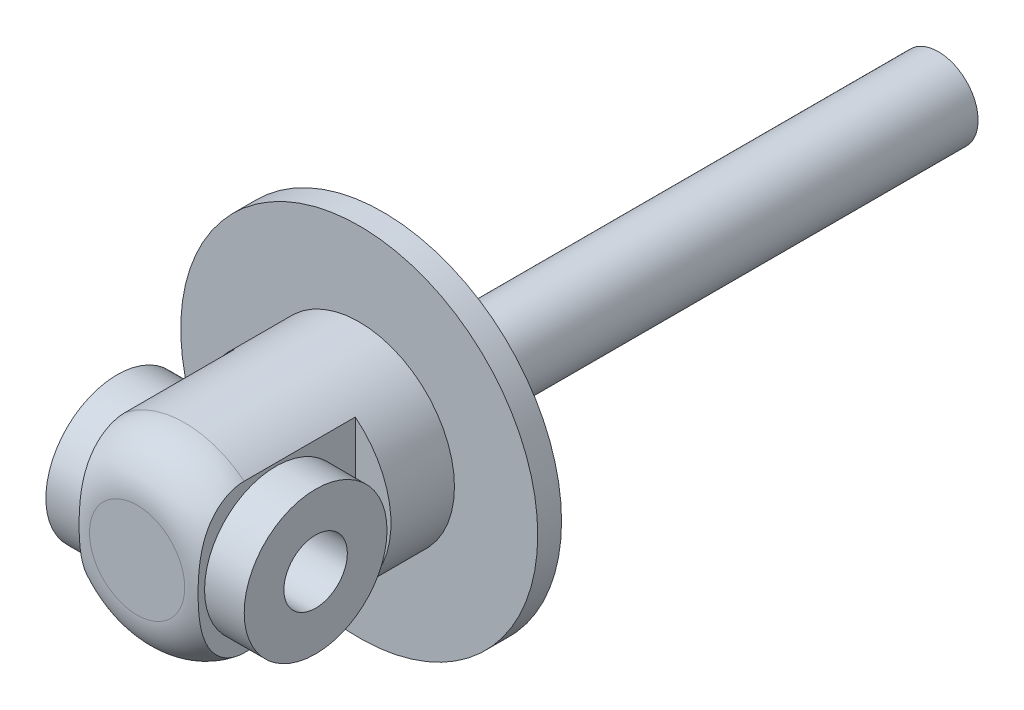
ISO-10303-21;
HEADER;
FILE_DESCRIPTION(('STEP AP214'),'2;1');
FILE_NAME('part.step','',(''),(''),'','','');
FILE_SCHEMA(('AUTOMOTIVE_DESIGN { 1 0 10303 214 1 1 1 1 }'));
ENDSEC;
DATA;
#1=APPLICATION_CONTEXT('core data for automotive mechanical design processes');
#2=APPLICATION_PROTOCOL_DEFINITION('international standard','automotive_design',2000,#1);
#3=PRODUCT_CONTEXT('',#1,'mechanical');
#4=PRODUCT('Part','Part','',(#3));
#5=PRODUCT_RELATED_PRODUCT_CATEGORY('part','',(#4));
#6=PRODUCT_DEFINITION_FORMATION('','',#4);
#7=PRODUCT_DEFINITION_CONTEXT('part definition',#1,'design');
#8=PRODUCT_DEFINITION('design','',#6,#7);
#9=PRODUCT_DEFINITION_SHAPE('','',#8);
#10=(LENGTH_UNIT() NAMED_UNIT(*) SI_UNIT(.MILLI.,.METRE.));
#11=(NAMED_UNIT(*) PLANE_ANGLE_UNIT() SI_UNIT($,.RADIAN.));
#12=(NAMED_UNIT(*) SI_UNIT($,.STERADIAN.) SOLID_ANGLE_UNIT());
#13=UNCERTAINTY_MEASURE_WITH_UNIT(LENGTH_MEASURE(1.E-05),#10,'distance_accuracy_value','');
#14=(GEOMETRIC_REPRESENTATION_CONTEXT(3) GLOBAL_UNCERTAINTY_ASSIGNED_CONTEXT((#13)) GLOBAL_UNIT_ASSIGNED_CONTEXT((#10,
#11,#12)) REPRESENTATION_CONTEXT('',''));
#15=CARTESIAN_POINT('',(0.,0.,0.));
#16=DIRECTION('',(0.,0.,1.));
#17=DIRECTION('',(1.,0.,0.));
#18=AXIS2_PLACEMENT_3D('',#15,#16,#17);
#19=CARTESIAN_POINT('',(-7.5,-22.5,8.));
#20=DIRECTION('',(1.,0.,0.));
#21=DIRECTION('',(0.,0.,-1.));
#22=AXIS2_PLACEMENT_3D('',#19,#20,#21);
#23=PLANE('',#22);
#24=CARTESIAN_POINT('',(-7.5,0.,27.8094750193111));
#25=CARTESIAN_POINT('',(-7.5,0.18452162824242,27.8094752958151));
#26=CARTESIAN_POINT('',(-7.5,0.369043480287192,27.8077270322999));
#27=CARTESIAN_POINT('',(-7.5,0.737999394292285,27.8006130628877));
#28=CARTESIAN_POINT('',(-7.5,0.922433463434385,27.7952477367066));
#29=CARTESIAN_POINT('',(-7.5,1.29122559425462,27.780538513706));
#30=CARTESIAN_POINT('',(-7.5,1.47558358999919,27.7711929215574));
#31=CARTESIAN_POINT('',(-7.5,1.84401846668315,27.7479507640883));
#32=CARTESIAN_POINT('',(-7.5,2.02809534398339,27.734054140347));
#33=CARTESIAN_POINT('',(-7.5,2.39498843631837,27.701027325669));
#34=CARTESIAN_POINT('',(-7.5,2.57780665418326,27.6819201299087));
#35=CARTESIAN_POINT('',(-7.5,2.94269408038083,27.6375682217561));
#36=CARTESIAN_POINT('',(-7.5,3.12476323156505,27.6123230495969));
#37=CARTESIAN_POINT('',(-7.5,3.6691632505479,27.5259360262262));
#38=CARTESIAN_POINT('',(-7.5,4.02997739530099,27.4541196223952));
#39=CARTESIAN_POINT('',(-7.5,4.57935988961709,27.315114172541));
#40=CARTESIAN_POINT('',(-7.5,4.77122256452969,27.2608348848703));
#41=CARTESIAN_POINT('',(-7.5,5.15109529504943,27.1402411036094));
#42=CARTESIAN_POINT('',(-7.5,5.33910680786539,27.0739312594077));
#43=CARTESIAN_POINT('',(-7.5,5.70992505463463,26.9281486989919));
#44=CARTESIAN_POINT('',(-7.5,5.8927332791208,26.8486797977089));
#45=CARTESIAN_POINT('',(-7.5,6.25155879665883,26.6756224712841));
#46=CARTESIAN_POINT('',(-7.5,6.42757723883459,26.5820364486502));
#47=CARTESIAN_POINT('',(-7.5,6.74413785402998,26.3958384208508));
#48=CARTESIAN_POINT('',(-7.5,6.8859302136676,26.3053527427416));
#49=CARTESIAN_POINT('',(-7.5,7.16205254122039,26.1136422044668));
#50=CARTESIAN_POINT('',(-7.5,7.29638393401336,26.0124194056704));
#51=CARTESIAN_POINT('',(-7.5,7.55627452274061,25.7991822855038));
#52=CARTESIAN_POINT('',(-7.5,7.6818315054992,25.6871652583255));
#53=CARTESIAN_POINT('',(-7.5,7.92270374400352,25.4525813942248));
#54=CARTESIAN_POINT('',(-7.5,8.03801892249803,25.3300144777409));
#55=CARTESIAN_POINT('',(-7.5,8.25792234562975,25.0736714823962));
#56=CARTESIAN_POINT('',(-7.5,8.36240569865935,24.9398051473305));
#57=CARTESIAN_POINT('',(-7.5,8.55796576900282,24.662616920615));
#58=CARTESIAN_POINT('',(-7.5,8.64904436046083,24.5192963548439));
#59=CARTESIAN_POINT('',(-7.5,8.81636481076627,24.2243409104845));
#60=CARTESIAN_POINT('',(-7.5,8.89261579636783,24.0727112205184));
#61=CARTESIAN_POINT('',(-7.5,9.02909243430965,23.7624095052739));
#62=CARTESIAN_POINT('',(-7.5,9.08932115899453,23.6037388369551));
#63=CARTESIAN_POINT('',(-7.5,9.1849514334904,23.3052245459151));
#64=CARTESIAN_POINT('',(-7.5,9.22272405795734,23.1661361294911));
#65=CARTESIAN_POINT('',(-7.5,9.28547940350164,22.8851087613884));
#66=CARTESIAN_POINT('',(-7.5,9.31046370365637,22.7431701638949));
#67=CARTESIAN_POINT('',(-7.5,9.34730641699015,22.4576599589478));
#68=CARTESIAN_POINT('',(-7.5,9.35917031033292,22.3140890586128));
#69=CARTESIAN_POINT('',(-7.5,9.36963164548865,22.0264648581988));
#70=CARTESIAN_POINT('',(-7.5,9.36822954903948,21.8824115750842));
#71=CARTESIAN_POINT('',(-7.5,9.35280339576898,21.6061914815275));
#72=CARTESIAN_POINT('',(-7.5,9.33976569953801,21.4739684759154));
#73=CARTESIAN_POINT('',(-7.5,9.3025636387872,21.2110534946456));
#74=CARTESIAN_POINT('',(-7.5,9.27839574533066,21.0803620180608));
#75=CARTESIAN_POINT('',(-7.5,9.21922065645586,20.8215410609612));
#76=CARTESIAN_POINT('',(-7.5,9.18421981495561,20.6934101253726));
#77=CARTESIAN_POINT('',(-7.5,9.10374552536161,20.4404340442512));
#78=CARTESIAN_POINT('',(-7.5,9.05826815366643,20.3155901493276));
#79=CARTESIAN_POINT('',(-7.5,8.95699564520569,20.0692031015505));
#80=CARTESIAN_POINT('',(-7.5,8.90113499399755,19.9476868658852));
#81=CARTESIAN_POINT('',(-7.5,8.77987692751896,19.7094920695403));
#82=CARTESIAN_POINT('',(-7.5,8.71447610526943,19.5928152563103));
#83=CARTESIAN_POINT('',(-7.5,8.50489875856372,19.2509911073174));
#84=CARTESIAN_POINT('',(-7.5,8.34729299116935,19.0339195251877));
#85=CARTESIAN_POINT('',(-7.5,7.98870608163153,18.609337427954));
#86=CARTESIAN_POINT('',(-7.5,7.78529755950601,18.4039002281567));
#87=CARTESIAN_POINT('',(-7.5,7.35109040646743,18.0246758733926));
#88=CARTESIAN_POINT('',(-7.5,7.12029612399675,17.8508837047537));
#89=CARTESIAN_POINT('',(-7.5,6.69864287979115,17.5744409595824));
#90=CARTESIAN_POINT('',(-7.5,6.51223410047273,17.4648689537028));
#91=CARTESIAN_POINT('',(-7.5,6.13034538679086,17.2626904112623));
#92=CARTESIAN_POINT('',(-7.5,5.93486117014359,17.1700919878543));
#93=CARTESIAN_POINT('',(-7.5,5.53658641063458,17.0006313082269));
#94=CARTESIAN_POINT('',(-7.5,5.33377659321381,16.9238147555949));
#95=CARTESIAN_POINT('',(-7.5,4.92331428460811,16.784875362625));
#96=CARTESIAN_POINT('',(-7.5,4.71566315546475,16.7227484430634));
#97=CARTESIAN_POINT('',(-7.5,4.02250667384636,16.5386673542946));
#98=CARTESIAN_POINT('',(-7.5,3.52942656369882,16.4449803111871));
#99=CARTESIAN_POINT('',(-7.5,2.78498720051467,16.3412352530644));
#100=CARTESIAN_POINT('',(-7.5,2.53568557770051,16.3127705467372));
#101=CARTESIAN_POINT('',(-7.5,2.0361243493744,16.2658269581612));
#102=CARTESIAN_POINT('',(-7.5,1.78586486368143,16.2473468655649));
#103=CARTESIAN_POINT('',(-7.5,1.28363112408654,16.2184283009414));
#104=CARTESIAN_POINT('',(-7.5,1.03165466176093,16.208031590786));
#105=CARTESIAN_POINT('',(-7.5,0.527501194688694,16.1941849220444));
#106=CARTESIAN_POINT('',(-7.5,0.275324180848925,16.1907352988047));
#107=CARTESIAN_POINT('',(-7.5,-0.228731345602963,16.1903333462322));
#108=CARTESIAN_POINT('',(-7.5,-0.480609853630161,16.193373232494));
#109=CARTESIAN_POINT('',(-7.5,-0.984173581494252,16.2063332691715));
#110=CARTESIAN_POINT('',(-7.5,-1.23585881660872,16.2162528039696));
#111=CARTESIAN_POINT('',(-7.5,-1.76278825668932,16.2454935008677));
#112=CARTESIAN_POINT('',(-7.5,-2.0379899010917,16.2656211327378));
#113=CARTESIAN_POINT('',(-7.5,-2.58731345976837,16.3180418431017));
#114=CARTESIAN_POINT('',(-7.5,-2.86143522597443,16.3503365349836));
#115=CARTESIAN_POINT('',(-7.5,-3.40623279358436,16.4300545548583));
#116=CARTESIAN_POINT('',(-7.5,-3.67691867401873,16.4774071358833));
#117=CARTESIAN_POINT('',(-7.5,-4.21439476079951,16.5907053400646));
#118=CARTESIAN_POINT('',(-7.5,-4.4811862031647,16.6566449229111));
#119=CARTESIAN_POINT('',(-7.5,-4.94217748017442,16.7911834026755));
#120=CARTESIAN_POINT('',(-7.5,-5.13778160857807,16.8549558474619));
#121=CARTESIAN_POINT('',(-7.5,-5.52399422741739,16.9961265709521));
#122=CARTESIAN_POINT('',(-7.5,-5.71460418712136,17.0735207892669));
#123=CARTESIAN_POINT('',(-7.5,-6.08921987221889,17.2430793617625));
#124=CARTESIAN_POINT('',(-7.5,-6.27322442084438,17.3352463319138));
#125=CARTESIAN_POINT('',(-7.5,-6.63256976145457,17.5351759469553));
#126=CARTESIAN_POINT('',(-7.5,-6.80791280693597,17.6429345063483));
#127=CARTESIAN_POINT('',(-7.5,-7.10989658300674,17.8487615005736));
#128=CARTESIAN_POINT('',(-7.5,-7.23870103997639,17.9436617626469));
#129=CARTESIAN_POINT('',(-7.5,-7.48856622066219,18.143229826346));
#130=CARTESIAN_POINT('',(-7.5,-7.60962602152205,18.2478987883735));
#131=CARTESIAN_POINT('',(-7.5,-7.84271387792474,18.4668045949393));
#132=CARTESIAN_POINT('',(-7.5,-7.95474473789612,18.5810384459287));
#133=CARTESIAN_POINT('',(-7.5,-8.16854933672494,18.8187268203134));
#134=CARTESIAN_POINT('',(-7.5,-8.27032449994957,18.9421800591116));
#135=CARTESIAN_POINT('',(-7.5,-8.46313596223061,19.1987356397018));
#136=CARTESIAN_POINT('',(-7.5,-8.55408255407203,19.3319055781875));
#137=CARTESIAN_POINT('',(-7.5,-8.72304401015934,19.6061418402457));
#138=CARTESIAN_POINT('',(-7.5,-8.80106500403696,19.747204378254));
#139=CARTESIAN_POINT('',(-7.5,-8.94309470867639,20.0362068877473));
#140=CARTESIAN_POINT('',(-7.5,-9.00710515749598,20.1841460034049));
#141=CARTESIAN_POINT('',(-7.5,-9.12014361193693,20.4856380297523));
#142=CARTESIAN_POINT('',(-7.5,-9.16917373274798,20.6391901444676));
#143=CARTESIAN_POINT('',(-7.5,-9.24643392787081,20.9313639562727));
#144=CARTESIAN_POINT('',(-7.5,-9.2764768563288,21.0695088202567));
#145=CARTESIAN_POINT('',(-7.5,-9.32406143536891,21.3479315795213));
#146=CARTESIAN_POINT('',(-7.5,-9.34160421520928,21.4882092809526));
#147=CARTESIAN_POINT('',(-7.5,-9.36396002322678,21.769719609589));
#148=CARTESIAN_POINT('',(-7.5,-9.36877802253041,21.9109518422674));
#149=CARTESIAN_POINT('',(-7.5,-9.36563613906261,22.1932734390957));
#150=CARTESIAN_POINT('',(-7.5,-9.35767657732182,22.3343628067459));
#151=CARTESIAN_POINT('',(-7.5,-9.32998563551062,22.6064011749062));
#152=CARTESIAN_POINT('',(-7.5,-9.31102660205279,22.7374295539783));
#153=CARTESIAN_POINT('',(-7.5,-9.26218788836622,22.9974780227225));
#154=CARTESIAN_POINT('',(-7.5,-9.23230470755187,23.1264974548056));
#155=CARTESIAN_POINT('',(-7.5,-9.16196479385525,23.3815508516768));
#156=CARTESIAN_POINT('',(-7.5,-9.12151307666088,23.5075862018083));
#157=CARTESIAN_POINT('',(-7.5,-9.03044888037393,23.7559772755244));
#158=CARTESIAN_POINT('',(-7.5,-8.97983258590813,23.8783315975104));
#159=CARTESIAN_POINT('',(-7.5,-8.8680617574251,24.1205569584555));
#160=CARTESIAN_POINT('',(-7.5,-8.80674877020291,24.2403549182387));
#161=CARTESIAN_POINT('',(-7.5,-8.67480187441993,24.4747211723639));
#162=CARTESIAN_POINT('',(-7.5,-8.60416462323317,24.5892875713423));
#163=CARTESIAN_POINT('',(-7.5,-8.37928997825773,24.9242270275788));
#164=CARTESIAN_POINT('',(-7.5,-8.21201407264852,25.13600210755));
#165=CARTESIAN_POINT('',(-7.5,-7.832942739178,25.5504485361803));
#166=CARTESIAN_POINT('',(-7.5,-7.61853228584699,25.7507010772538));
#167=CARTESIAN_POINT('',(-7.5,-7.16337882817298,26.1185076671662));
#168=CARTESIAN_POINT('',(-7.5,-6.92262753032979,26.2860513710234));
#169=CARTESIAN_POINT('',(-7.5,-6.4788664395953,26.5545024709803));
#170=CARTESIAN_POINT('',(-7.5,-6.27970729507799,26.6619013252763));
#171=CARTESIAN_POINT('',(-7.5,-5.87254463104012,26.858559219587));
#172=CARTESIAN_POINT('',(-7.5,-5.66453691936401,26.9478095430477));
#173=CARTESIAN_POINT('',(-7.5,-5.24180758530232,27.1096214973705));
#174=CARTESIAN_POINT('',(-7.5,-5.02707553901331,27.1821555960046));
#175=CARTESIAN_POINT('',(-7.5,-4.59305326757356,27.3121001369762));
#176=CARTESIAN_POINT('',(-7.5,-4.37376133898656,27.3695048137837));
#177=CARTESIAN_POINT('',(-7.5,-3.81417726059937,27.4981886749365));
#178=CARTESIAN_POINT('',(-7.5,-3.47183296905169,27.5604951716191));
#179=CARTESIAN_POINT('',(-7.5,-2.78359200614869,27.6609019684328));
#180=CARTESIAN_POINT('',(-7.5,-2.43769315620305,27.6989863972919));
#181=CARTESIAN_POINT('',(-7.5,-1.91723181279188,27.7425563308733));
#182=CARTESIAN_POINT('',(-7.5,-1.74318957751326,27.7548291128016));
#183=CARTESIAN_POINT('',(-7.5,-1.39487161182967,27.7753986995787));
#184=CARTESIAN_POINT('',(-7.5,-1.22059588725638,27.7836956019396));
#185=CARTESIAN_POINT('',(-7.5,-0.87196539298604,27.796777523185));
#186=CARTESIAN_POINT('',(-7.5,-0.697610658492171,27.8015635129394));
#187=CARTESIAN_POINT('',(-7.5,-0.348837350643893,27.8079121855994));
#188=CARTESIAN_POINT('',(-7.5,-0.174418775305038,27.8094747579462));
#189=CARTESIAN_POINT('',(-7.5,0.,27.8094750193111));
#190=B_SPLINE_CURVE_WITH_KNOTS('',3,(#24,#25,#26,#27,#28,#29,#30,#31,#32,#33,#34,#35,#36,#37,
#38,#39,#40,#41,#42,#43,#44,#45,#46,#47,#48,#49,#50,#51,#52,#53,#54,#55,#56,#57,#58,#59,#60,#61,
#62,#63,#64,#65,#66,#67,#68,#69,#70,#71,#72,#73,#74,#75,#76,#77,#78,#79,#80,#81,#82,#83,#84,#85,
#86,#87,#88,#89,#90,#91,#92,#93,#94,#95,#96,#97,#98,#99,#100,#101,#102,#103,#104,#105,#106,#107,
#108,#109,#110,#111,#112,#113,#114,#115,#116,#117,#118,#119,#120,#121,#122,#123,#124,#125,#126,
#127,#128,#129,#130,#131,#132,#133,#134,#135,#136,#137,#138,#139,#140,#141,#142,#143,#144,#145,
#146,#147,#148,#149,#150,#151,#152,#153,#154,#155,#156,#157,#158,#159,#160,#161,#162,#163,#164,
#165,#166,#167,#168,#169,#170,#171,#172,#173,#174,#175,#176,#177,#178,#179,#180,#181,#182,#183,
#184,#185,#186,#187,#188,#189),.UNSPECIFIED.,.T.,.F.,(4,2,2,2,2,2,2,2,2,2,2,2,2,2,2,2,2,2,2,2,2,
2,2,2,2,2,2,2,2,2,2,2,2,2,2,2,2,2,2,2,2,2,2,2,2,2,2,2,2,2,2,2,2,2,2,2,2,2,2,2,2,2,2,2,2,2,2,2,2,
2,2,2,2,2,2,2,2,2,2,2,2,2,4),(0.,0.553556541747908,1.10705498067111,1.66078940935171,
2.21453094651203,2.7658672034967,3.31724477121585,4.41912680182767,5.01698525599297,
5.61461314908642,6.21206808675634,6.80942146164093,7.31357153503217,7.81762499361292,
8.32180513447661,8.82598907791493,9.33467160980088,9.84328295415676,10.3515802378956,
10.8597799828438,11.291588037567,11.7233427606026,12.1549170790764,12.5864763761706,
12.9845986570771,13.3828472534997,13.7808627038906,14.1790274594521,14.579795450788,
14.9807069160888,15.7821103743006,16.6461503316802,17.5100532757815,18.1578732554314,
18.8060020817716,19.4559821948789,20.1057815998326,21.6069748462105,22.3596793389022,
23.1122925673176,23.8687687149109,24.6252813779039,25.3808870860739,26.1364251884592,
26.9640249034878,27.7917343993232,28.6156111127982,29.4392203950451,30.0559954213971,
30.6725869093732,31.2892877047367,31.9058271963483,32.3853559200308,32.8649416785199,
33.3443778968313,33.823747436381,34.3068464150843,34.7897156366604,35.2725249226045,
35.7552660053908,36.1788379642465,36.6023716529343,37.0257398573389,37.4490974249689,
37.8458122806135,38.2426543730445,38.639308470493,39.0361117351622,39.4393886143668,
39.8428104576492,40.6491243408277,41.5260051520067,42.403162850804,43.0810551134699,
43.7592721958252,44.4385984678268,45.1181832448309,46.1608437011148,47.2041866484774,
47.7275747628343,48.2509500399341,48.7741805338585,49.2974289735857),.UNSPECIFIED.);
#191=CARTESIAN_POINT('',(-7.5,-9.3674969975976,22.));
#192=VERTEX_POINT('',#191);
#193=CARTESIAN_POINT('',(-7.5,9.36749699759766,21.9999999999999));
#194=VERTEX_POINT('',#193);
#195=EDGE_CURVE('E147',#192,#194,#190,.T.);
#196=ORIENTED_EDGE('',*,*,#195,.T.);
#197=DIRECTION('',(0.,0.,-1.));
#198=VECTOR('',#197,1.);
#199=CARTESIAN_POINT('',(-7.5,9.3674969975976,28.));
#200=LINE('',#199,#198);
#201=CARTESIAN_POINT('',(-7.5,9.36749699759759,8.));
#202=VERTEX_POINT('',#201);
#203=EDGE_CURVE('E98',#202,#194,#200,.F.);
#204=ORIENTED_EDGE('',*,*,#203,.F.);
#205=DIRECTION('',(0.,1.,0.));
#206=VECTOR('',#205,1.);
#207=CARTESIAN_POINT('',(-7.5,-22.5,8.));
#208=LINE('',#207,#206);
#209=CARTESIAN_POINT('',(-7.5,-9.36749699759761,8.));
#210=VERTEX_POINT('',#209);
#211=EDGE_CURVE('E90',#210,#202,#208,.T.);
#212=ORIENTED_EDGE('',*,*,#211,.F.);
#213=DIRECTION('',(0.,0.,-1.));
#214=VECTOR('',#213,1.);
#215=CARTESIAN_POINT('',(-7.5,-9.3674969975976,28.));
#216=LINE('',#215,#214);
#217=EDGE_CURVE('E68',#192,#210,#216,.T.);
#218=ORIENTED_EDGE('',*,*,#217,.F.);
#219=EDGE_LOOP('',(#196,#204,#212,#218));
#220=FACE_BOUND('',#219,.T.);
#221=CARTESIAN_POINT('',(-7.5,0.,18.));
#222=DIRECTION('',(1.,0.,0.));
#223=DIRECTION('',(0.,0.,-1.));
#224=AXIS2_PLACEMENT_3D('',#221,#222,#223);
#225=CIRCLE('',#224,9.);
#226=CARTESIAN_POINT('',(-7.5,0.,9.00000000000001));
#227=VERTEX_POINT('',#226);
#228=EDGE_CURVE('E11',#227,#227,#225,.F.);
#229=ORIENTED_EDGE('',*,*,#228,.F.);
#230=EDGE_LOOP('',(#229));
#231=FACE_BOUND('',#230,.T.);
#232=ADVANCED_FACE('F42',(#220,#231),#23,.F.);
#233=CARTESIAN_POINT('',(7.5,-22.5,8.));
#234=DIRECTION('',(-1.,0.,0.));
#235=DIRECTION('',(0.,0.,1.));
#236=AXIS2_PLACEMENT_3D('',#233,#234,#235);
#237=PLANE('',#236);
#238=CARTESIAN_POINT('',(7.5,0.,27.8094750193111));
#239=CARTESIAN_POINT('',(7.5,-0.18452162824242,27.8094752958151));
#240=CARTESIAN_POINT('',(7.5,-0.369043480287192,27.8077270322999));
#241=CARTESIAN_POINT('',(7.5,-0.737999394292286,27.8006130628877));
#242=CARTESIAN_POINT('',(7.5,-0.922433463434386,27.7952477367066));
#243=CARTESIAN_POINT('',(7.5,-1.29122559425462,27.780538513706));
#244=CARTESIAN_POINT('',(7.5,-1.47558358999919,27.7711929215574));
#245=CARTESIAN_POINT('',(7.5,-1.84401846668315,27.7479507640883));
#246=CARTESIAN_POINT('',(7.5,-2.0280953439834,27.734054140347));
#247=CARTESIAN_POINT('',(7.5,-2.39498843631837,27.701027325669));
#248=CARTESIAN_POINT('',(7.5,-2.57780665418327,27.6819201299087));
#249=CARTESIAN_POINT('',(7.5,-2.94269408038084,27.6375682217561));
#250=CARTESIAN_POINT('',(7.5,-3.12476323156505,27.6123230495969));
#251=CARTESIAN_POINT('',(7.5,-3.6691632505479,27.5259360262262));
#252=CARTESIAN_POINT('',(7.5,-4.029977395301,27.4541196223952));
#253=CARTESIAN_POINT('',(7.5,-4.57935988961709,27.315114172541));
#254=CARTESIAN_POINT('',(7.5,-4.7712225645297,27.2608348848703));
#255=CARTESIAN_POINT('',(7.5,-5.15109529504943,27.1402411036094));
#256=CARTESIAN_POINT('',(7.5,-5.3391068078654,27.0739312594077));
#257=CARTESIAN_POINT('',(7.5,-5.70992505463463,26.9281486989919));
#258=CARTESIAN_POINT('',(7.5,-5.8927332791208,26.8486797977089));
#259=CARTESIAN_POINT('',(7.5,-6.25155879665883,26.6756224712841));
#260=CARTESIAN_POINT('',(7.5,-6.4275772388346,26.5820364486501));
#261=CARTESIAN_POINT('',(7.5,-6.74413785402998,26.3958384208508));
#262=CARTESIAN_POINT('',(7.5,-6.8859302136676,26.3053527427416));
#263=CARTESIAN_POINT('',(7.5,-7.16205254122039,26.1136422044668));
#264=CARTESIAN_POINT('',(7.5,-7.29638393401336,26.0124194056704));
#265=CARTESIAN_POINT('',(7.5,-7.55627452274061,25.7991822855038));
#266=CARTESIAN_POINT('',(7.5,-7.6818315054992,25.6871652583255));
#267=CARTESIAN_POINT('',(7.5,-7.92270374400352,25.4525813942248));
#268=CARTESIAN_POINT('',(7.5,-8.03801892249803,25.3300144777409));
#269=CARTESIAN_POINT('',(7.5,-8.25792234562975,25.0736714823962));
#270=CARTESIAN_POINT('',(7.5,-8.36240569865935,24.9398051473305));
#271=CARTESIAN_POINT('',(7.5,-8.55796576900282,24.662616920615));
#272=CARTESIAN_POINT('',(7.5,-8.64904436046083,24.5192963548439));
#273=CARTESIAN_POINT('',(7.5,-8.81636481076627,24.2243409104845));
#274=CARTESIAN_POINT('',(7.5,-8.89261579636783,24.0727112205184));
#275=CARTESIAN_POINT('',(7.5,-9.02909243430965,23.7624095052739));
#276=CARTESIAN_POINT('',(7.5,-9.08932115899453,23.6037388369551));
#277=CARTESIAN_POINT('',(7.5,-9.1849514334904,23.3052245459151));
#278=CARTESIAN_POINT('',(7.5,-9.22272405795733,23.1661361294911));
#279=CARTESIAN_POINT('',(7.5,-9.28547940350163,22.8851087613884));
#280=CARTESIAN_POINT('',(7.5,-9.31046370365637,22.7431701638949));
#281=CARTESIAN_POINT('',(7.5,-9.34730641699015,22.4576599589478));
#282=CARTESIAN_POINT('',(7.5,-9.35917031033292,22.3140890586128));
#283=CARTESIAN_POINT('',(7.5,-9.36963164548865,22.0264648581988));
#284=CARTESIAN_POINT('',(7.5,-9.36822954903947,21.8824115750842));
#285=CARTESIAN_POINT('',(7.5,-9.35280339576898,21.6061914815275));
#286=CARTESIAN_POINT('',(7.5,-9.33976569953801,21.4739684759153));
#287=CARTESIAN_POINT('',(7.5,-9.3025636387872,21.2110534946456));
#288=CARTESIAN_POINT('',(7.5,-9.27839574533065,21.0803620180608));
#289=CARTESIAN_POINT('',(7.5,-9.21922065645586,20.8215410609612));
#290=CARTESIAN_POINT('',(7.5,-9.1842198149556,20.6934101253726));
#291=CARTESIAN_POINT('',(7.5,-9.1037455253616,20.4404340442512));
#292=CARTESIAN_POINT('',(7.5,-9.05826815366643,20.3155901493276));
#293=CARTESIAN_POINT('',(7.5,-8.95699564520569,20.0692031015505));
#294=CARTESIAN_POINT('',(7.5,-8.90113499399755,19.9476868658852));
#295=CARTESIAN_POINT('',(7.5,-8.77987692751896,19.7094920695403));
#296=CARTESIAN_POINT('',(7.5,-8.71447610526942,19.5928152563103));
#297=CARTESIAN_POINT('',(7.5,-8.50489875856371,19.2509911073174));
#298=CARTESIAN_POINT('',(7.5,-8.34729299116934,19.0339195251877));
#299=CARTESIAN_POINT('',(7.5,-7.98870608163152,18.609337427954));
#300=CARTESIAN_POINT('',(7.5,-7.78529755950601,18.4039002281567));
#301=CARTESIAN_POINT('',(7.5,-7.35109040646742,18.0246758733926));
#302=CARTESIAN_POINT('',(7.5,-7.12029612399674,17.8508837047537));
#303=CARTESIAN_POINT('',(7.5,-6.69864287979115,17.5744409595824));
#304=CARTESIAN_POINT('',(7.5,-6.51223410047272,17.4648689537028));
#305=CARTESIAN_POINT('',(7.5,-6.13034538679085,17.2626904112622));
#306=CARTESIAN_POINT('',(7.5,-5.93486117014357,17.1700919878543));
#307=CARTESIAN_POINT('',(7.5,-5.53658641063457,17.0006313082269));
#308=CARTESIAN_POINT('',(7.5,-5.33377659321379,16.9238147555949));
#309=CARTESIAN_POINT('',(7.5,-4.92331428460809,16.784875362625));
#310=CARTESIAN_POINT('',(7.5,-4.71566315546473,16.7227484430634));
#311=CARTESIAN_POINT('',(7.5,-4.02250667384634,16.5386673542946));
#312=CARTESIAN_POINT('',(7.5,-3.5294265636988,16.4449803111871));
#313=CARTESIAN_POINT('',(7.5,-2.78498720051465,16.3412352530644));
#314=CARTESIAN_POINT('',(7.5,-2.53568557770048,16.3127705467372));
#315=CARTESIAN_POINT('',(7.5,-2.03612434937437,16.2658269581612));
#316=CARTESIAN_POINT('',(7.5,-1.7858648636814,16.2473468655649));
#317=CARTESIAN_POINT('',(7.5,-1.28363112408651,16.2184283009414));
#318=CARTESIAN_POINT('',(7.5,-1.0316546617609,16.208031590786));
#319=CARTESIAN_POINT('',(7.5,-0.527501194688664,16.1941849220444));
#320=CARTESIAN_POINT('',(7.5,-0.275324180848895,16.1907352988047));
#321=CARTESIAN_POINT('',(7.5,0.228731345602994,16.1903333462322));
#322=CARTESIAN_POINT('',(7.5,0.480609853630194,16.193373232494));
#323=CARTESIAN_POINT('',(7.5,0.984173581494286,16.2063332691715));
#324=CARTESIAN_POINT('',(7.5,1.23585881660876,16.2162528039697));
#325=CARTESIAN_POINT('',(7.5,1.76278825668935,16.2454935008677));
#326=CARTESIAN_POINT('',(7.5,2.03798990109173,16.2656211327378));
#327=CARTESIAN_POINT('',(7.5,2.5873134597684,16.3180418431017));
#328=CARTESIAN_POINT('',(7.5,2.86143522597445,16.3503365349836));
#329=CARTESIAN_POINT('',(7.5,3.40623279358438,16.4300545548583));
#330=CARTESIAN_POINT('',(7.5,3.67691867401874,16.4774071358833));
#331=CARTESIAN_POINT('',(7.5,4.21439476079952,16.5907053400646));
#332=CARTESIAN_POINT('',(7.5,4.48118620316471,16.6566449229111));
#333=CARTESIAN_POINT('',(7.5,4.94217748017443,16.7911834026755));
#334=CARTESIAN_POINT('',(7.5,5.13778160857808,16.8549558474619));
#335=CARTESIAN_POINT('',(7.5,5.5239942274174,16.9961265709521));
#336=CARTESIAN_POINT('',(7.5,5.71460418712137,17.073520789267));
#337=CARTESIAN_POINT('',(7.5,6.0892198722189,17.2430793617625));
#338=CARTESIAN_POINT('',(7.5,6.27322442084439,17.3352463319138));
#339=CARTESIAN_POINT('',(7.5,6.63256976145457,17.5351759469553));
#340=CARTESIAN_POINT('',(7.5,6.80791280693598,17.6429345063483));
#341=CARTESIAN_POINT('',(7.5,7.10989658300674,17.8487615005737));
#342=CARTESIAN_POINT('',(7.5,7.2387010399764,17.9436617626469));
#343=CARTESIAN_POINT('',(7.5,7.48856622066219,18.143229826346));
#344=CARTESIAN_POINT('',(7.5,7.60962602152205,18.2478987883735));
#345=CARTESIAN_POINT('',(7.5,7.84271387792474,18.4668045949393));
#346=CARTESIAN_POINT('',(7.5,7.95474473789612,18.5810384459287));
#347=CARTESIAN_POINT('',(7.5,8.16854933672494,18.8187268203134));
#348=CARTESIAN_POINT('',(7.5,8.27032449994957,18.9421800591116));
#349=CARTESIAN_POINT('',(7.5,8.46313596223061,19.1987356397018));
#350=CARTESIAN_POINT('',(7.5,8.55408255407203,19.3319055781875));
#351=CARTESIAN_POINT('',(7.5,8.72304401015934,19.6061418402457));
#352=CARTESIAN_POINT('',(7.5,8.80106500403696,19.747204378254));
#353=CARTESIAN_POINT('',(7.5,8.94309470867639,20.0362068877473));
#354=CARTESIAN_POINT('',(7.5,9.00710515749598,20.1841460034049));
#355=CARTESIAN_POINT('',(7.5,9.12014361193692,20.4856380297523));
#356=CARTESIAN_POINT('',(7.5,9.16917373274798,20.6391901444676));
#357=CARTESIAN_POINT('',(7.5,9.24643392787081,20.9313639562727));
#358=CARTESIAN_POINT('',(7.5,9.27647685632879,21.0695088202567));
#359=CARTESIAN_POINT('',(7.5,9.32406143536891,21.3479315795213));
#360=CARTESIAN_POINT('',(7.5,9.34160421520928,21.4882092809526));
#361=CARTESIAN_POINT('',(7.5,9.36396002322678,21.769719609589));
#362=CARTESIAN_POINT('',(7.5,9.36877802253041,21.9109518422674));
#363=CARTESIAN_POINT('',(7.5,9.3656361390626,22.1932734390957));
#364=CARTESIAN_POINT('',(7.5,9.35767657732181,22.3343628067459));
#365=CARTESIAN_POINT('',(7.5,9.32998563551062,22.6064011749062));
#366=CARTESIAN_POINT('',(7.5,9.31102660205278,22.7374295539783));
#367=CARTESIAN_POINT('',(7.5,9.26218788836622,22.9974780227225));
#368=CARTESIAN_POINT('',(7.5,9.23230470755187,23.1264974548056));
#369=CARTESIAN_POINT('',(7.5,9.16196479385525,23.3815508516768));
#370=CARTESIAN_POINT('',(7.5,9.12151307666088,23.5075862018083));
#371=CARTESIAN_POINT('',(7.5,9.03044888037393,23.7559772755244));
#372=CARTESIAN_POINT('',(7.5,8.97983258590813,23.8783315975104));
#373=CARTESIAN_POINT('',(7.5,8.86806175742509,24.1205569584555));
#374=CARTESIAN_POINT('',(7.5,8.8067487702029,24.2403549182387));
#375=CARTESIAN_POINT('',(7.5,8.67480187441993,24.4747211723639));
#376=CARTESIAN_POINT('',(7.5,8.60416462323316,24.5892875713423));
#377=CARTESIAN_POINT('',(7.5,8.37928997825773,24.9242270275788));
#378=CARTESIAN_POINT('',(7.5,8.21201407264851,25.13600210755));
#379=CARTESIAN_POINT('',(7.5,7.832942739178,25.5504485361803));
#380=CARTESIAN_POINT('',(7.5,7.61853228584699,25.7507010772538));
#381=CARTESIAN_POINT('',(7.5,7.16337882817298,26.1185076671662));
#382=CARTESIAN_POINT('',(7.5,6.92262753032979,26.2860513710234));
#383=CARTESIAN_POINT('',(7.5,6.47886643959529,26.5545024709803));
#384=CARTESIAN_POINT('',(7.5,6.27970729507799,26.6619013252763));
#385=CARTESIAN_POINT('',(7.5,5.87254463104012,26.858559219587));
#386=CARTESIAN_POINT('',(7.5,5.664536919364,26.9478095430477));
#387=CARTESIAN_POINT('',(7.5,5.24180758530232,27.1096214973705));
#388=CARTESIAN_POINT('',(7.5,5.0270755390133,27.1821555960046));
#389=CARTESIAN_POINT('',(7.5,4.59305326757355,27.3121001369762));
#390=CARTESIAN_POINT('',(7.5,4.37376133898655,27.3695048137837));
#391=CARTESIAN_POINT('',(7.5,3.81417726059936,27.4981886749365));
#392=CARTESIAN_POINT('',(7.5,3.47183296905169,27.5604951716191));
#393=CARTESIAN_POINT('',(7.5,2.78359200614869,27.6609019684328));
#394=CARTESIAN_POINT('',(7.5,2.43769315620304,27.6989863972919));
#395=CARTESIAN_POINT('',(7.5,1.91723181279187,27.7425563308733));
#396=CARTESIAN_POINT('',(7.5,1.74318957751326,27.7548291128016));
#397=CARTESIAN_POINT('',(7.5,1.39487161182967,27.7753986995787));
#398=CARTESIAN_POINT('',(7.5,1.22059588725638,27.7836956019396));
#399=CARTESIAN_POINT('',(7.5,0.87196539298604,27.796777523185));
#400=CARTESIAN_POINT('',(7.5,0.69761065849217,27.8015635129394));
#401=CARTESIAN_POINT('',(7.5,0.348837350643893,27.8079121855994));
#402=CARTESIAN_POINT('',(7.5,0.174418775305038,27.8094747579462));
#403=CARTESIAN_POINT('',(7.5,0.,27.8094750193111));
#404=B_SPLINE_CURVE_WITH_KNOTS('',3,(#238,#239,#240,#241,#242,#243,#244,#245,#246,#247,#248,
#249,#250,#251,#252,#253,#254,#255,#256,#257,#258,#259,#260,#261,#262,#263,#264,#265,#266,#267,
#268,#269,#270,#271,#272,#273,#274,#275,#276,#277,#278,#279,#280,#281,#282,#283,#284,#285,#286,
#287,#288,#289,#290,#291,#292,#293,#294,#295,#296,#297,#298,#299,#300,#301,#302,#303,#304,#305,
#306,#307,#308,#309,#310,#311,#312,#313,#314,#315,#316,#317,#318,#319,#320,#321,#322,#323,#324,
#325,#326,#327,#328,#329,#330,#331,#332,#333,#334,#335,#336,#337,#338,#339,#340,#341,#342,#343,
#344,#345,#346,#347,#348,#349,#350,#351,#352,#353,#354,#355,#356,#357,#358,#359,#360,#361,#362,
#363,#364,#365,#366,#367,#368,#369,#370,#371,#372,#373,#374,#375,#376,#377,#378,#379,#380,#381,
#382,#383,#384,#385,#386,#387,#388,#389,#390,#391,#392,#393,#394,#395,#396,#397,#398,#399,#400,
#401,#402,#403),.UNSPECIFIED.,.T.,.F.,(4,2,2,2,2,2,2,2,2,2,2,2,2,2,2,2,2,2,2,2,2,2,2,2,2,2,2,2,
2,2,2,2,2,2,2,2,2,2,2,2,2,2,2,2,2,2,2,2,2,2,2,2,2,2,2,2,2,2,2,2,2,2,2,2,2,2,2,2,2,2,2,2,2,2,2,2,
2,2,2,2,2,2,4),(0.,0.553556541747909,1.10705498067111,1.66078940935171,2.21453094651203,
2.7658672034967,3.31724477121586,4.41912680182767,5.01698525599298,5.61461314908642,
6.21206808675634,6.80942146164093,7.31357153503217,7.81762499361292,8.32180513447662,
8.82598907791493,9.33467160980089,9.84328295415676,10.3515802378956,10.8597799828438,
11.291588037567,11.7233427606026,12.1549170790764,12.5864763761706,12.9845986570771,
13.3828472534997,13.7808627038906,14.1790274594522,14.579795450788,14.9807069160888,
15.7821103743006,16.6461503316802,17.5100532757815,18.1578732554314,18.8060020817716,
19.4559821948789,20.1057815998326,21.6069748462106,22.3596793389022,23.1122925673176,
23.8687687149109,24.6252813779039,25.3808870860739,26.1364251884592,26.9640249034878,
27.7917343993232,28.6156111127982,29.4392203950451,30.0559954213971,30.6725869093733,
31.2892877047367,31.9058271963483,32.3853559200308,32.8649416785199,33.3443778968313,
33.823747436381,34.3068464150844,34.7897156366604,35.2725249226045,35.7552660053908,
36.1788379642465,36.6023716529343,37.0257398573389,37.4490974249689,37.8458122806135,
38.2426543730445,38.639308470493,39.0361117351622,39.4393886143668,39.8428104576492,
40.6491243408277,41.5260051520067,42.403162850804,43.0810551134699,43.7592721958252,
44.4385984678267,45.1181832448308,46.1608437011148,47.2041866484774,47.7275747628343,
48.2509500399341,48.7741805338585,49.2974289735857),.UNSPECIFIED.);
#405=CARTESIAN_POINT('',(7.5,9.3674969975976,22.));
#406=VERTEX_POINT('',#405);
#407=CARTESIAN_POINT('',(7.5,-9.36749699759765,21.9999999999999));
#408=VERTEX_POINT('',#407);
#409=EDGE_CURVE('E95',#406,#408,#404,.T.);
#410=ORIENTED_EDGE('',*,*,#409,.T.);
#411=DIRECTION('',(0.,0.,-1.));
#412=VECTOR('',#411,1.);
#413=CARTESIAN_POINT('',(7.5,-9.3674969975976,28.));
#414=LINE('',#413,#412);
#415=CARTESIAN_POINT('',(7.5,-9.3674969975976,8.));
#416=VERTEX_POINT('',#415);
#417=EDGE_CURVE('E111',#416,#408,#414,.F.);
#418=ORIENTED_EDGE('',*,*,#417,.F.);
#419=DIRECTION('',(0.,1.,0.));
#420=VECTOR('',#419,1.);
#421=CARTESIAN_POINT('',(7.5,-22.5,8.));
#422=LINE('',#421,#420);
#423=CARTESIAN_POINT('',(7.5,9.3674969975976,8.));
#424=VERTEX_POINT('',#423);
#425=EDGE_CURVE('E100',#416,#424,#422,.T.);
#426=ORIENTED_EDGE('',*,*,#425,.T.);
#427=DIRECTION('',(0.,0.,-1.));
#428=VECTOR('',#427,1.);
#429=CARTESIAN_POINT('',(7.5,9.3674969975976,28.));
#430=LINE('',#429,#428);
#431=EDGE_CURVE('E60',#406,#424,#430,.T.);
#432=ORIENTED_EDGE('',*,*,#431,.F.);
#433=EDGE_LOOP('',(#410,#418,#426,#432));
#434=FACE_BOUND('',#433,.T.);
#435=CARTESIAN_POINT('',(7.5,0.,18.));
#436=DIRECTION('',(-1.,0.,0.));
#437=DIRECTION('',(0.,0.,1.));
#438=AXIS2_PLACEMENT_3D('',#435,#436,#437);
#439=CIRCLE('',#438,9.);
#440=CARTESIAN_POINT('',(7.5,0.,27.));
#441=VERTEX_POINT('',#440);
#442=EDGE_CURVE('E47',#441,#441,#439,.F.);
#443=ORIENTED_EDGE('',*,*,#442,.F.);
#444=EDGE_LOOP('',(#443));
#445=FACE_BOUND('',#444,.T.);
#446=ADVANCED_FACE('F161',(#434,#445),#237,.F.);
#447=CARTESIAN_POINT('',(0.,0.,-3.));
#448=DIRECTION('',(0.,0.,1.));
#449=DIRECTION('',(1.,0.,0.));
#450=AXIS2_PLACEMENT_3D('',#447,#448,#449);
#451=CYLINDRICAL_SURFACE('',#450,22.5);
#452=CARTESIAN_POINT('',(0.,0.,-3.));
#453=DIRECTION('',(0.,0.,1.));
#454=DIRECTION('',(1.,0.,0.));
#455=AXIS2_PLACEMENT_3D('',#452,#453,#454);
#456=CIRCLE('',#455,22.5);
#457=CARTESIAN_POINT('',(22.5,0.,-3.));
#458=VERTEX_POINT('',#457);
#459=EDGE_CURVE('E134',#458,#458,#456,.T.);
#460=ORIENTED_EDGE('',*,*,#459,.T.);
#461=EDGE_LOOP('',(#460));
#462=FACE_BOUND('',#461,.T.);
#463=CARTESIAN_POINT('',(0.,0.,0.));
#464=DIRECTION('',(0.,0.,1.));
#465=DIRECTION('',(1.,0.,0.));
#466=AXIS2_PLACEMENT_3D('',#463,#464,#465);
#467=CIRCLE('',#466,22.5);
#468=CARTESIAN_POINT('',(22.5,0.,0.));
#469=VERTEX_POINT('',#468);
#470=EDGE_CURVE('E130',#469,#469,#467,.T.);
#471=ORIENTED_EDGE('',*,*,#470,.F.);
#472=EDGE_LOOP('',(#471));
#473=FACE_BOUND('',#472,.T.);
#474=ADVANCED_FACE('F185',(#462,#473),#451,.T.);
#475=CARTESIAN_POINT('',(0.,0.,-3.));
#476=DIRECTION('',(0.,0.,1.));
#477=DIRECTION('',(1.,0.,0.));
#478=AXIS2_PLACEMENT_3D('',#475,#476,#477);
#479=PLANE('',#478);
#480=CARTESIAN_POINT('',(0.,0.,-3.));
#481=DIRECTION('',(0.,0.,-1.));
#482=DIRECTION('',(-1.,0.,0.));
#483=AXIS2_PLACEMENT_3D('',#480,#481,#482);
#484=CIRCLE('',#483,5.);
#485=CARTESIAN_POINT('',(-5.,0.,-3.));
#486=VERTEX_POINT('',#485);
#487=EDGE_CURVE('E126',#486,#486,#484,.T.);
#488=ORIENTED_EDGE('',*,*,#487,.F.);
#489=EDGE_LOOP('',(#488));
#490=FACE_BOUND('',#489,.T.);
#491=ORIENTED_EDGE('',*,*,#459,.F.);
#492=EDGE_LOOP('',(#491));
#493=FACE_BOUND('',#492,.T.);
#494=ADVANCED_FACE('F182',(#490,#493),#479,.F.);
#495=CARTESIAN_POINT('',(0.,0.,0.));
#496=DIRECTION('',(0.,0.,1.));
#497=DIRECTION('',(1.,0.,0.));
#498=AXIS2_PLACEMENT_3D('',#495,#496,#497);
#499=PLANE('',#498);
#500=CARTESIAN_POINT('',(0.,0.,0.));
#501=DIRECTION('',(0.,0.,1.));
#502=DIRECTION('',(1.,0.,0.));
#503=AXIS2_PLACEMENT_3D('',#500,#501,#502);
#504=CIRCLE('',#503,12.);
#505=CARTESIAN_POINT('',(12.,0.,0.));
#506=VERTEX_POINT('',#505);
#507=EDGE_CURVE('E121',#506,#506,#504,.T.);
#508=ORIENTED_EDGE('',*,*,#507,.F.);
#509=EDGE_LOOP('',(#508));
#510=FACE_BOUND('',#509,.T.);
#511=ORIENTED_EDGE('',*,*,#470,.T.);
#512=EDGE_LOOP('',(#511));
#513=FACE_BOUND('',#512,.T.);
#514=ADVANCED_FACE('F180',(#510,#513),#499,.T.);
#515=CARTESIAN_POINT('',(0.,0.,-73.));
#516=DIRECTION('',(0.,0.,1.));
#517=DIRECTION('',(1.,0.,0.));
#518=AXIS2_PLACEMENT_3D('',#515,#516,#517);
#519=CYLINDRICAL_SURFACE('',#518,5.);
#520=CARTESIAN_POINT('',(0.,0.,-73.));
#521=DIRECTION('',(0.,0.,-1.));
#522=DIRECTION('',(-1.,0.,0.));
#523=AXIS2_PLACEMENT_3D('',#520,#521,#522);
#524=CIRCLE('',#523,5.);
#525=CARTESIAN_POINT('',(-5.,0.,-73.));
#526=VERTEX_POINT('',#525);
#527=EDGE_CURVE('E120',#526,#526,#524,.T.);
#528=ORIENTED_EDGE('',*,*,#527,.F.);
#529=EDGE_LOOP('',(#528));
#530=FACE_BOUND('',#529,.T.);
#531=ORIENTED_EDGE('',*,*,#487,.T.);
#532=EDGE_LOOP('',(#531));
#533=FACE_BOUND('',#532,.T.);
#534=ADVANCED_FACE('F176',(#530,#533),#519,.T.);
#535=CARTESIAN_POINT('',(0.,0.,-73.));
#536=DIRECTION('',(0.,0.,-1.));
#537=DIRECTION('',(-1.,0.,0.));
#538=AXIS2_PLACEMENT_3D('',#535,#536,#537);
#539=PLANE('',#538);
#540=ORIENTED_EDGE('',*,*,#527,.T.);
#541=EDGE_LOOP('',(#540));
#542=FACE_BOUND('',#541,.T.);
#543=ADVANCED_FACE('F173',(#542),#539,.T.);
#544=CARTESIAN_POINT('',(0.,0.,28.));
#545=DIRECTION('',(0.,0.,-1.));
#546=DIRECTION('',(-1.,0.,0.));
#547=AXIS2_PLACEMENT_3D('',#544,#545,#546);
#548=CYLINDRICAL_SURFACE('',#547,12.);
#549=CARTESIAN_POINT('',(0.,0.,22.));
#550=DIRECTION('',(0.,0.,1.));
#551=DIRECTION('',(1.,0.,0.));
#552=AXIS2_PLACEMENT_3D('',#549,#550,#551);
#553=CIRCLE('',#552,12.);
#554=EDGE_CURVE('E144',#194,#406,#553,.F.);
#555=ORIENTED_EDGE('',*,*,#554,.T.);
#556=ORIENTED_EDGE('',*,*,#431,.T.);
#557=CARTESIAN_POINT('',(0.,0.,8.));
#558=DIRECTION('',(0.,0.,-1.));
#559=DIRECTION('',(-1.,0.,0.));
#560=AXIS2_PLACEMENT_3D('',#557,#558,#559);
#561=CIRCLE('',#560,12.);
#562=EDGE_CURVE('E94',#424,#416,#561,.T.);
#563=ORIENTED_EDGE('',*,*,#562,.T.);
#564=ORIENTED_EDGE('',*,*,#417,.T.);
#565=EDGE_CURVE('E109',#408,#192,#553,.F.);
#566=ORIENTED_EDGE('',*,*,#565,.T.);
#567=ORIENTED_EDGE('',*,*,#217,.T.);
#568=CARTESIAN_POINT('',(0.,0.,8.));
#569=DIRECTION('',(0.,0.,-1.));
#570=DIRECTION('',(-1.,0.,0.));
#571=AXIS2_PLACEMENT_3D('',#568,#569,#570);
#572=CIRCLE('',#571,12.);
#573=EDGE_CURVE('E88',#210,#202,#572,.T.);
#574=ORIENTED_EDGE('',*,*,#573,.T.);
#575=ORIENTED_EDGE('',*,*,#203,.T.);
#576=EDGE_LOOP('',(#555,#556,#563,#564,#566,#567,#574,#575));
#577=FACE_BOUND('',#576,.T.);
#578=ORIENTED_EDGE('',*,*,#507,.T.);
#579=EDGE_LOOP('',(#578));
#580=FACE_BOUND('',#579,.T.);
#581=ADVANCED_FACE('F105',(#577,#580),#548,.T.);
#582=CARTESIAN_POINT('',(0.,0.,28.));
#583=DIRECTION('',(0.,0.,1.));
#584=DIRECTION('',(1.,0.,0.));
#585=AXIS2_PLACEMENT_3D('',#582,#583,#584);
#586=PLANE('',#585);
#587=CARTESIAN_POINT('',(0.,0.,28.));
#588=DIRECTION('',(0.,0.,1.));
#589=DIRECTION('',(1.,0.,0.));
#590=AXIS2_PLACEMENT_3D('',#587,#588,#589);
#591=CIRCLE('',#590,6.);
#592=CARTESIAN_POINT('',(6.,0.,28.));
#593=VERTEX_POINT('',#592);
#594=EDGE_CURVE('E125',#593,#593,#591,.T.);
#595=ORIENTED_EDGE('',*,*,#594,.T.);
#596=EDGE_LOOP('',(#595));
#597=FACE_BOUND('',#596,.T.);
#598=ADVANCED_FACE('F167',(#597),#586,.T.);
#599=CARTESIAN_POINT('',(0.,0.,22.));
#600=DIRECTION('',(0.,0.,1.));
#601=DIRECTION('',(1.,0.,0.));
#602=AXIS2_PLACEMENT_3D('',#599,#600,#601);
#603=TOROIDAL_SURFACE('',#602,6.,6.);
#604=ORIENTED_EDGE('',*,*,#409,.F.);
#605=ORIENTED_EDGE('',*,*,#554,.F.);
#606=ORIENTED_EDGE('',*,*,#195,.F.);
#607=ORIENTED_EDGE('',*,*,#565,.F.);
#608=EDGE_LOOP('',(#604,#605,#606,#607));
#609=FACE_BOUND('',#608,.T.);
#610=ORIENTED_EDGE('',*,*,#594,.F.);
#611=EDGE_LOOP('',(#610));
#612=FACE_BOUND('',#611,.T.);
#613=ADVANCED_FACE('F44',(#609,#612),#603,.T.);
#614=CARTESIAN_POINT('',(-27.07,-22.5,8.));
#615=DIRECTION('',(0.,0.,-1.));
#616=DIRECTION('',(-1.,0.,0.));
#617=AXIS2_PLACEMENT_3D('',#614,#615,#616);
#618=PLANE('',#617);
#619=ORIENTED_EDGE('',*,*,#211,.T.);
#620=ORIENTED_EDGE('',*,*,#573,.F.);
#621=EDGE_LOOP('',(#619,#620));
#622=FACE_BOUND('',#621,.T.);
#623=ADVANCED_FACE('F89',(#622),#618,.F.);
#624=CARTESIAN_POINT('',(27.07,-22.5,8.));
#625=DIRECTION('',(0.,0.,-1.));
#626=DIRECTION('',(-1.,0.,0.));
#627=AXIS2_PLACEMENT_3D('',#624,#625,#626);
#628=PLANE('',#627);
#629=ORIENTED_EDGE('',*,*,#425,.F.);
#630=ORIENTED_EDGE('',*,*,#562,.F.);
#631=EDGE_LOOP('',(#629,#630));
#632=FACE_BOUND('',#631,.T.);
#633=ADVANCED_FACE('F166',(#632),#628,.F.);
#634=CARTESIAN_POINT('',(12.5,0.,18.));
#635=DIRECTION('',(-1.,0.,0.));
#636=DIRECTION('',(0.,0.,1.));
#637=AXIS2_PLACEMENT_3D('',#634,#635,#636);
#638=CYLINDRICAL_SURFACE('',#637,9.);
#639=CARTESIAN_POINT('',(12.5,0.,18.));
#640=DIRECTION('',(1.,0.,0.));
#641=DIRECTION('',(0.,0.,-1.));
#642=AXIS2_PLACEMENT_3D('',#639,#640,#641);
#643=CIRCLE('',#642,9.);
#644=CARTESIAN_POINT('',(12.5,0.,9.00000000000001));
#645=VERTEX_POINT('',#644);
#646=EDGE_CURVE('E101',#645,#645,#643,.T.);
#647=ORIENTED_EDGE('',*,*,#646,.F.);
#648=EDGE_LOOP('',(#647));
#649=FACE_BOUND('',#648,.T.);
#650=ORIENTED_EDGE('',*,*,#442,.T.);
#651=EDGE_LOOP('',(#650));
#652=FACE_BOUND('',#651,.T.);
#653=ADVANCED_FACE('F234',(#649,#652),#638,.T.);
#654=CARTESIAN_POINT('',(12.5,0.,18.));
#655=DIRECTION('',(1.,0.,0.));
#656=DIRECTION('',(0.,0.,-1.));
#657=AXIS2_PLACEMENT_3D('',#654,#655,#656);
#658=PLANE('',#657);
#659=ORIENTED_EDGE('',*,*,#646,.T.);
#660=EDGE_LOOP('',(#659));
#661=FACE_BOUND('',#660,.T.);
#662=CARTESIAN_POINT('',(12.5,0.,18.));
#663=DIRECTION('',(1.,0.,0.));
#664=DIRECTION('',(0.,0.,-1.));
#665=AXIS2_PLACEMENT_3D('',#662,#663,#664);
#666=CIRCLE('',#665,4.);
#667=CARTESIAN_POINT('',(12.5,0.,14.));
#668=VERTEX_POINT('',#667);
#669=EDGE_CURVE('E217',#668,#668,#666,.T.);
#670=ORIENTED_EDGE('',*,*,#669,.F.);
#671=EDGE_LOOP('',(#670));
#672=FACE_BOUND('',#671,.T.);
#673=ADVANCED_FACE('F232',(#661,#672),#658,.T.);
#674=CARTESIAN_POINT('',(-22.5,0.,18.));
#675=DIRECTION('',(1.,0.,0.));
#676=DIRECTION('',(0.,0.,-1.));
#677=AXIS2_PLACEMENT_3D('',#674,#675,#676);
#678=CYLINDRICAL_SURFACE('',#677,4.);
#679=ORIENTED_EDGE('',*,*,#669,.T.);
#680=EDGE_LOOP('',(#679));
#681=FACE_BOUND('',#680,.T.);
#682=CARTESIAN_POINT('',(-12.5,0.,18.));
#683=DIRECTION('',(1.,0.,0.));
#684=DIRECTION('',(0.,0.,-1.));
#685=AXIS2_PLACEMENT_3D('',#682,#683,#684);
#686=CIRCLE('',#685,4.);
#687=CARTESIAN_POINT('',(-12.5,0.,14.));
#688=VERTEX_POINT('',#687);
#689=EDGE_CURVE('E221',#688,#688,#686,.T.);
#690=ORIENTED_EDGE('',*,*,#689,.F.);
#691=EDGE_LOOP('',(#690));
#692=FACE_BOUND('',#691,.T.);
#693=ADVANCED_FACE('F229',(#681,#692),#678,.F.);
#694=CARTESIAN_POINT('',(-12.5,0.,18.));
#695=DIRECTION('',(1.,0.,0.));
#696=DIRECTION('',(0.,0.,-1.));
#697=AXIS2_PLACEMENT_3D('',#694,#695,#696);
#698=CIRCLE('',#697,9.);
#699=CARTESIAN_POINT('',(-12.5,0.,9.00000000000001));
#700=VERTEX_POINT('',#699);
#701=EDGE_CURVE('E213',#700,#700,#698,.T.);
#702=ORIENTED_EDGE('',*,*,#701,.T.);
#703=EDGE_LOOP('',(#702));
#704=FACE_BOUND('',#703,.T.);
#705=ORIENTED_EDGE('',*,*,#228,.T.);
#706=EDGE_LOOP('',(#705));
#707=FACE_BOUND('',#706,.T.);
#708=ADVANCED_FACE('F241',(#704,#707),#638,.T.);
#709=CARTESIAN_POINT('',(-12.5,0.,18.));
#710=DIRECTION('',(1.,0.,0.));
#711=DIRECTION('',(0.,0.,-1.));
#712=AXIS2_PLACEMENT_3D('',#709,#710,#711);
#713=PLANE('',#712);
#714=ORIENTED_EDGE('',*,*,#701,.F.);
#715=EDGE_LOOP('',(#714));
#716=FACE_BOUND('',#715,.T.);
#717=ORIENTED_EDGE('',*,*,#689,.T.);
#718=EDGE_LOOP('',(#717));
#719=FACE_BOUND('',#718,.T.);
#720=ADVANCED_FACE('F246',(#716,#719),#713,.F.);
#721=CLOSED_SHELL('',(#232,#446,#474,#494,#514,#534,#543,#581,#598,#613,#623,#633,#653,#673,
#693,#708,#720));
#722=MANIFOLD_SOLID_BREP('B2',#721);
#723=ADVANCED_BREP_SHAPE_REPRESENTATION('',(#18,#722),#14);
#724=SHAPE_DEFINITION_REPRESENTATION(#9,#723);
ENDSEC;
END-ISO-10303-21;
